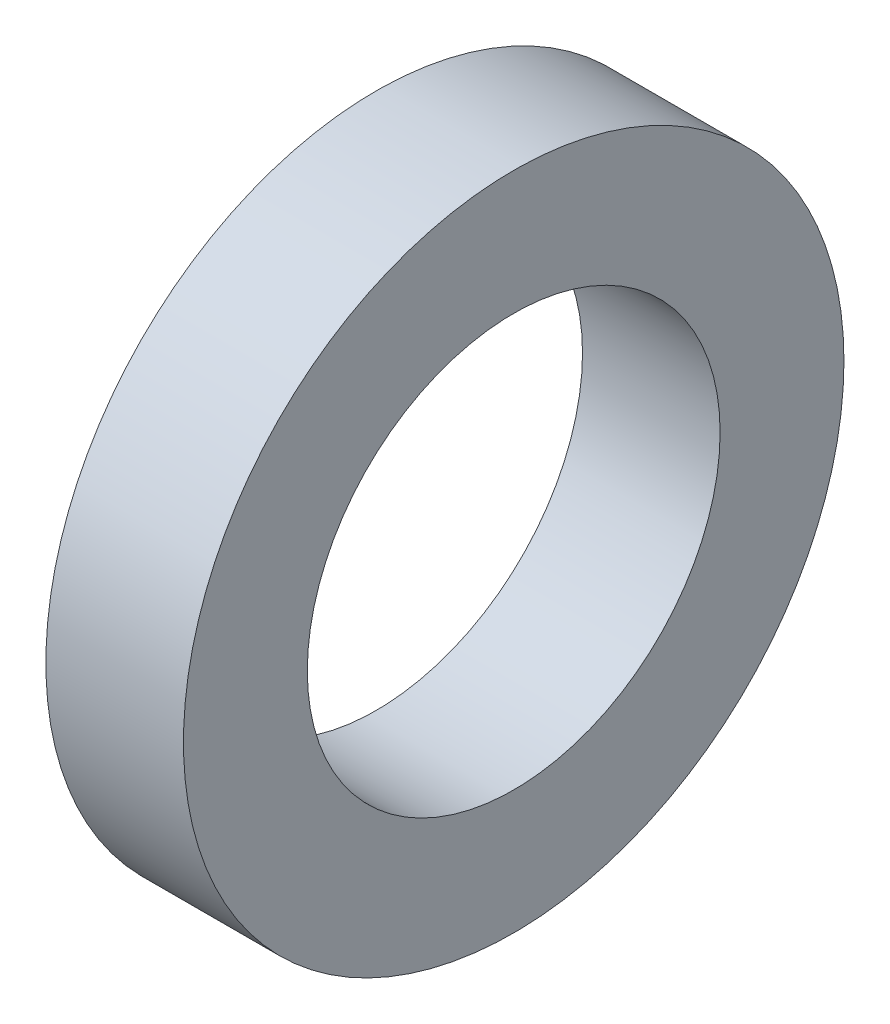
ISO-10303-21;
HEADER;
FILE_DESCRIPTION(('STEP AP214'),'2;1');
FILE_NAME('part.step','',(''),(''),'','','');
FILE_SCHEMA(('AUTOMOTIVE_DESIGN { 1 0 10303 214 1 1 1 1 }'));
ENDSEC;
DATA;
#1=APPLICATION_CONTEXT('core data for automotive mechanical design processes');
#2=APPLICATION_PROTOCOL_DEFINITION('international standard','automotive_design',2000,#1);
#3=PRODUCT_CONTEXT('',#1,'mechanical');
#4=PRODUCT('Part','Part','',(#3));
#5=PRODUCT_RELATED_PRODUCT_CATEGORY('part','',(#4));
#6=PRODUCT_DEFINITION_FORMATION('','',#4);
#7=PRODUCT_DEFINITION_CONTEXT('part definition',#1,'design');
#8=PRODUCT_DEFINITION('design','',#6,#7);
#9=PRODUCT_DEFINITION_SHAPE('','',#8);
#10=(LENGTH_UNIT() NAMED_UNIT(*) SI_UNIT(.MILLI.,.METRE.));
#11=(NAMED_UNIT(*) PLANE_ANGLE_UNIT() SI_UNIT($,.RADIAN.));
#12=(NAMED_UNIT(*) SI_UNIT($,.STERADIAN.) SOLID_ANGLE_UNIT());
#13=UNCERTAINTY_MEASURE_WITH_UNIT(LENGTH_MEASURE(1.E-05),#10,'distance_accuracy_value','');
#14=(GEOMETRIC_REPRESENTATION_CONTEXT(3) GLOBAL_UNCERTAINTY_ASSIGNED_CONTEXT((#13)) GLOBAL_UNIT_ASSIGNED_CONTEXT((#10,
#11,#12)) REPRESENTATION_CONTEXT('',''));
#15=CARTESIAN_POINT('',(0.,0.,0.));
#16=DIRECTION('',(0.,0.,1.));
#17=DIRECTION('',(1.,0.,0.));
#18=AXIS2_PLACEMENT_3D('',#15,#16,#17);
#19=CARTESIAN_POINT('',(5.,0.,0.));
#20=DIRECTION('',(1.,0.,0.));
#21=DIRECTION('',(0.,0.,-1.));
#22=AXIS2_PLACEMENT_3D('',#19,#20,#21);
#23=PLANE('',#22);
#24=CARTESIAN_POINT('',(5.,0.,0.));
#25=DIRECTION('',(1.,0.,0.));
#26=DIRECTION('',(0.,0.,-1.));
#27=AXIS2_PLACEMENT_3D('',#24,#25,#26);
#28=CIRCLE('',#27,12.);
#29=CARTESIAN_POINT('',(5.,0.,-12.));
#30=VERTEX_POINT('',#29);
#31=EDGE_CURVE('E10',#30,#30,#28,.T.);
#32=ORIENTED_EDGE('',*,*,#31,.T.);
#33=EDGE_LOOP('',(#32));
#34=FACE_BOUND('',#33,.T.);
#35=CARTESIAN_POINT('',(5.,0.,0.));
#36=DIRECTION('',(1.,0.,0.));
#37=DIRECTION('',(0.,0.,-1.));
#38=AXIS2_PLACEMENT_3D('',#35,#36,#37);
#39=CIRCLE('',#38,7.5);
#40=CARTESIAN_POINT('',(5.,0.,-7.5));
#41=VERTEX_POINT('',#40);
#42=EDGE_CURVE('E42',#41,#41,#39,.T.);
#43=ORIENTED_EDGE('',*,*,#42,.F.);
#44=EDGE_LOOP('',(#43));
#45=FACE_BOUND('',#44,.T.);
#46=ADVANCED_FACE('F31',(#34,#45),#23,.T.);
#47=CARTESIAN_POINT('',(0.,0.,0.));
#48=DIRECTION('',(1.,0.,0.));
#49=DIRECTION('',(0.,0.,-1.));
#50=AXIS2_PLACEMENT_3D('',#47,#48,#49);
#51=PLANE('',#50);
#52=CARTESIAN_POINT('',(0.,0.,0.));
#53=DIRECTION('',(1.,0.,0.));
#54=DIRECTION('',(0.,0.,-1.));
#55=AXIS2_PLACEMENT_3D('',#52,#53,#54);
#56=CIRCLE('',#55,12.);
#57=CARTESIAN_POINT('',(0.,0.,-12.));
#58=VERTEX_POINT('',#57);
#59=EDGE_CURVE('E35',#58,#58,#56,.T.);
#60=ORIENTED_EDGE('',*,*,#59,.F.);
#61=EDGE_LOOP('',(#60));
#62=FACE_BOUND('',#61,.T.);
#63=CARTESIAN_POINT('',(0.,0.,0.));
#64=DIRECTION('',(1.,0.,0.));
#65=DIRECTION('',(0.,0.,-1.));
#66=AXIS2_PLACEMENT_3D('',#63,#64,#65);
#67=CIRCLE('',#66,7.5);
#68=CARTESIAN_POINT('',(0.,0.,-7.5));
#69=VERTEX_POINT('',#68);
#70=EDGE_CURVE('E44',#69,#69,#67,.T.);
#71=ORIENTED_EDGE('',*,*,#70,.T.);
#72=EDGE_LOOP('',(#71));
#73=FACE_BOUND('',#72,.T.);
#74=ADVANCED_FACE('F54',(#62,#73),#51,.F.);
#75=CARTESIAN_POINT('',(5.,0.,0.));
#76=DIRECTION('',(-1.,0.,0.));
#77=DIRECTION('',(0.,0.,1.));
#78=AXIS2_PLACEMENT_3D('',#75,#76,#77);
#79=CYLINDRICAL_SURFACE('',#78,12.);
#80=ORIENTED_EDGE('',*,*,#31,.F.);
#81=EDGE_LOOP('',(#80));
#82=FACE_BOUND('',#81,.T.);
#83=ORIENTED_EDGE('',*,*,#59,.T.);
#84=EDGE_LOOP('',(#83));
#85=FACE_BOUND('',#84,.T.);
#86=ADVANCED_FACE('F33',(#82,#85),#79,.T.);
#87=CARTESIAN_POINT('',(5.,0.,0.));
#88=DIRECTION('',(-1.,0.,0.));
#89=DIRECTION('',(0.,0.,1.));
#90=AXIS2_PLACEMENT_3D('',#87,#88,#89);
#91=CYLINDRICAL_SURFACE('',#90,7.5);
#92=ORIENTED_EDGE('',*,*,#42,.T.);
#93=EDGE_LOOP('',(#92));
#94=FACE_BOUND('',#93,.T.);
#95=ORIENTED_EDGE('',*,*,#70,.F.);
#96=EDGE_LOOP('',(#95));
#97=FACE_BOUND('',#96,.T.);
#98=ADVANCED_FACE('F50',(#94,#97),#91,.F.);
#99=CLOSED_SHELL('',(#46,#74,#86,#98));
#100=MANIFOLD_SOLID_BREP('B2',#99);
#101=ADVANCED_BREP_SHAPE_REPRESENTATION('',(#18,#100),#14);
#102=SHAPE_DEFINITION_REPRESENTATION(#9,#101);
ENDSEC;
END-ISO-10303-21;
